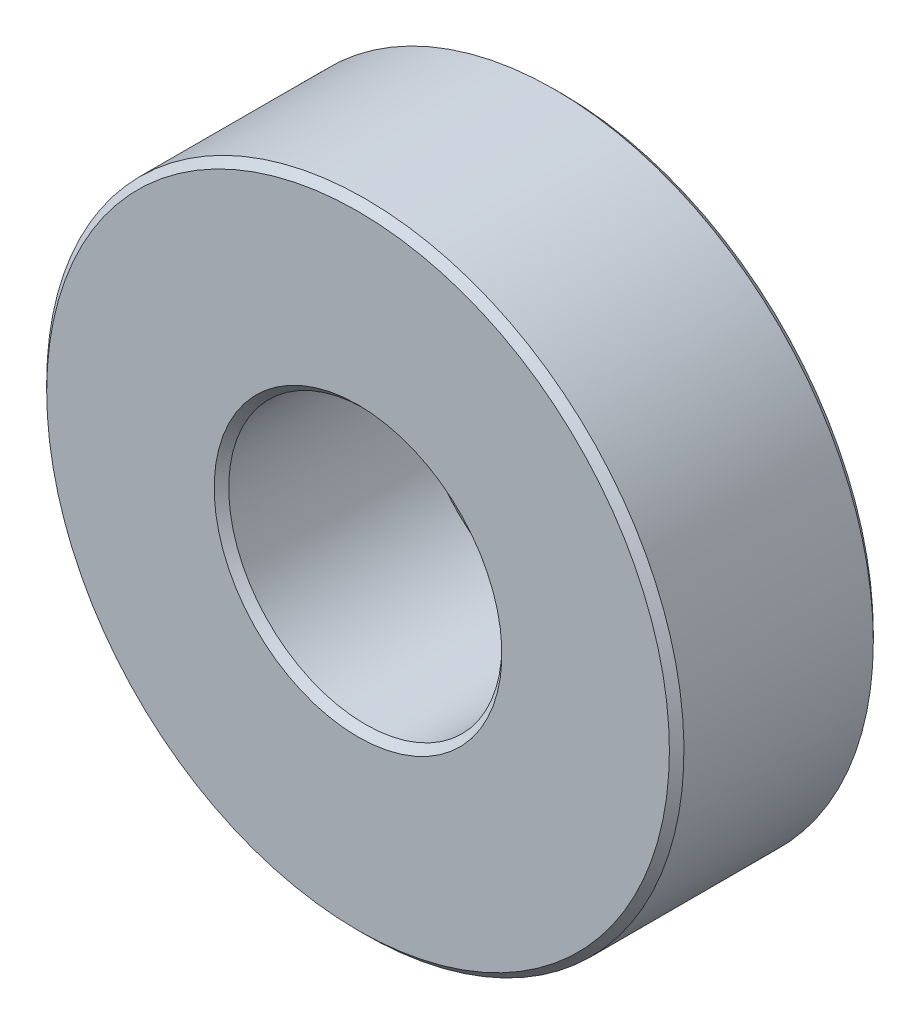
ISO-10303-21;
HEADER;
FILE_DESCRIPTION(('STEP AP214'),'2;1');
FILE_NAME('part.step','',(''),(''),'','','');
FILE_SCHEMA(('AUTOMOTIVE_DESIGN { 1 0 10303 214 1 1 1 1 }'));
ENDSEC;
DATA;
#1=APPLICATION_CONTEXT('core data for automotive mechanical design processes');
#2=APPLICATION_PROTOCOL_DEFINITION('international standard','automotive_design',2000,#1);
#3=PRODUCT_CONTEXT('',#1,'mechanical');
#4=PRODUCT('Part','Part','',(#3));
#5=PRODUCT_RELATED_PRODUCT_CATEGORY('part','',(#4));
#6=PRODUCT_DEFINITION_FORMATION('','',#4);
#7=PRODUCT_DEFINITION_CONTEXT('part definition',#1,'design');
#8=PRODUCT_DEFINITION('design','',#6,#7);
#9=PRODUCT_DEFINITION_SHAPE('','',#8);
#10=(LENGTH_UNIT() NAMED_UNIT(*) SI_UNIT(.MILLI.,.METRE.));
#11=(NAMED_UNIT(*) PLANE_ANGLE_UNIT() SI_UNIT($,.RADIAN.));
#12=(NAMED_UNIT(*) SI_UNIT($,.STERADIAN.) SOLID_ANGLE_UNIT());
#13=UNCERTAINTY_MEASURE_WITH_UNIT(LENGTH_MEASURE(1.E-05),#10,'distance_accuracy_value','');
#14=(GEOMETRIC_REPRESENTATION_CONTEXT(3) GLOBAL_UNCERTAINTY_ASSIGNED_CONTEXT((#13)) GLOBAL_UNIT_ASSIGNED_CONTEXT((#10,
#11,#12)) REPRESENTATION_CONTEXT('',''));
#15=CARTESIAN_POINT('',(0.,0.,0.));
#16=DIRECTION('',(0.,0.,1.));
#17=DIRECTION('',(1.,0.,0.));
#18=AXIS2_PLACEMENT_3D('',#15,#16,#17);
#19=CARTESIAN_POINT('',(0.,0.,0.));
#20=DIRECTION('',(0.,0.,-1.));
#21=DIRECTION('',(0.,1.,0.));
#22=AXIS2_PLACEMENT_3D('',#19,#20,#21);
#23=PLANE('',#22);
#24=CARTESIAN_POINT('',(0.,0.,-5.6843418860808E-11));
#25=DIRECTION('',(0.,0.,-1.));
#26=DIRECTION('',(0.,1.,0.));
#27=AXIS2_PLACEMENT_3D('',#24,#25,#26);
#28=CIRCLE('',#27,5.01650000001064);
#29=CARTESIAN_POINT('',(0.,5.01650000001064,-5.6843418860808E-11));
#30=VERTEX_POINT('',#29);
#31=EDGE_CURVE('E29',#30,#30,#28,.F.);
#32=ORIENTED_EDGE('',*,*,#31,.T.);
#33=EDGE_LOOP('',(#32));
#34=FACE_BOUND('',#33,.T.);
#35=CARTESIAN_POINT('',(0.,0.,0.));
#36=DIRECTION('',(0.,0.,1.));
#37=DIRECTION('',(1.,0.,0.));
#38=AXIS2_PLACEMENT_3D('',#35,#36,#37);
#39=CIRCLE('',#38,10.8585);
#40=CARTESIAN_POINT('',(10.8585,0.,0.));
#41=VERTEX_POINT('',#40);
#42=EDGE_CURVE('E15',#41,#41,#39,.T.);
#43=ORIENTED_EDGE('',*,*,#42,.F.);
#44=EDGE_LOOP('',(#43));
#45=FACE_BOUND('',#44,.T.);
#46=ADVANCED_FACE('F12',(#34,#45),#23,.T.);
#47=CARTESIAN_POINT('',(0.,0.,0.253999999999989));
#48=DIRECTION('',(0.,0.,1.));
#49=DIRECTION('',(1.,0.,0.));
#50=AXIS2_PLACEMENT_3D('',#47,#48,#49);
#51=CONICAL_SURFACE('',#50,11.1125,0.785398163397451);
#52=ORIENTED_EDGE('',*,*,#42,.T.);
#53=EDGE_LOOP('',(#52));
#54=FACE_BOUND('',#53,.T.);
#55=CARTESIAN_POINT('',(0.,0.,0.253999999999976));
#56=DIRECTION('',(0.,0.,-1.));
#57=DIRECTION('',(0.,1.,0.));
#58=AXIS2_PLACEMENT_3D('',#55,#56,#57);
#59=CIRCLE('',#58,11.1125);
#60=CARTESIAN_POINT('',(0.,11.1125,0.253999999999976));
#61=VERTEX_POINT('',#60);
#62=EDGE_CURVE('E27',#61,#61,#59,.F.);
#63=ORIENTED_EDGE('',*,*,#62,.F.);
#64=EDGE_LOOP('',(#63));
#65=FACE_BOUND('',#64,.T.);
#66=ADVANCED_FACE('F38',(#54,#65),#51,.T.);
#67=CARTESIAN_POINT('',(0.,0.,-5.6843418860808E-11));
#68=DIRECTION('',(0.,0.,-1.));
#69=DIRECTION('',(0.,1.,0.));
#70=AXIS2_PLACEMENT_3D('',#67,#68,#69);
#71=CONICAL_SURFACE('',#70,5.01650000001064,0.785398163285552);
#72=ORIENTED_EDGE('',*,*,#31,.F.);
#73=EDGE_LOOP('',(#72));
#74=FACE_BOUND('',#73,.T.);
#75=CARTESIAN_POINT('',(0.,0.,0.253999999999976));
#76=DIRECTION('',(0.,0.,-1.));
#77=DIRECTION('',(0.,1.,0.));
#78=AXIS2_PLACEMENT_3D('',#75,#76,#77);
#79=CIRCLE('',#78,4.7625);
#80=CARTESIAN_POINT('',(0.,4.7625,0.253999999999976));
#81=VERTEX_POINT('',#80);
#82=EDGE_CURVE('E34',#81,#81,#79,.F.);
#83=ORIENTED_EDGE('',*,*,#82,.T.);
#84=EDGE_LOOP('',(#83));
#85=FACE_BOUND('',#84,.T.);
#86=ADVANCED_FACE('F46',(#74,#85),#71,.F.);
#87=CARTESIAN_POINT('',(0.,0.,7.11200000000001));
#88=DIRECTION('',(0.,0.,-1.));
#89=DIRECTION('',(0.,1.,0.));
#90=AXIS2_PLACEMENT_3D('',#87,#88,#89);
#91=CYLINDRICAL_SURFACE('',#90,11.1125);
#92=CARTESIAN_POINT('',(0.,0.,6.85799999999998));
#93=DIRECTION('',(0.,0.,-1.));
#94=DIRECTION('',(-1.,0.,0.));
#95=AXIS2_PLACEMENT_3D('',#92,#93,#94);
#96=CIRCLE('',#95,11.1125);
#97=CARTESIAN_POINT('',(-11.1125,0.,6.85799999999997));
#98=VERTEX_POINT('',#97);
#99=EDGE_CURVE('E78',#98,#98,#96,.F.);
#100=ORIENTED_EDGE('',*,*,#99,.F.);
#101=EDGE_LOOP('',(#100));
#102=FACE_BOUND('',#101,.T.);
#103=ORIENTED_EDGE('',*,*,#62,.T.);
#104=EDGE_LOOP('',(#103));
#105=FACE_BOUND('',#104,.T.);
#106=ADVANCED_FACE('F66',(#102,#105),#91,.T.);
#107=CARTESIAN_POINT('',(0.,0.,7.11200000000001));
#108=DIRECTION('',(0.,0.,-1.));
#109=DIRECTION('',(0.,1.,0.));
#110=AXIS2_PLACEMENT_3D('',#107,#108,#109);
#111=CYLINDRICAL_SURFACE('',#110,4.7625);
#112=ORIENTED_EDGE('',*,*,#82,.F.);
#113=EDGE_LOOP('',(#112));
#114=FACE_BOUND('',#113,.T.);
#115=CARTESIAN_POINT('',(0.,0.,6.85800000002246));
#116=DIRECTION('',(0.,0.,1.));
#117=DIRECTION('',(1.,0.,0.));
#118=AXIS2_PLACEMENT_3D('',#115,#116,#117);
#119=CIRCLE('',#118,4.76250000002665);
#120=CARTESIAN_POINT('',(4.76250000002665,0.,6.85800000002246));
#121=VERTEX_POINT('',#120);
#122=EDGE_CURVE('E24',#121,#121,#119,.T.);
#123=ORIENTED_EDGE('',*,*,#122,.T.);
#124=EDGE_LOOP('',(#123));
#125=FACE_BOUND('',#124,.T.);
#126=ADVANCED_FACE('F62',(#114,#125),#111,.F.);
#127=CARTESIAN_POINT('',(0.,0.,6.85799999999997));
#128=DIRECTION('',(0.,0.,-1.));
#129=DIRECTION('',(0.,1.,0.));
#130=AXIS2_PLACEMENT_3D('',#127,#128,#129);
#131=CONICAL_SURFACE('',#130,11.1125,0.78539816339745);
#132=CARTESIAN_POINT('',(0.,0.,7.11199999999999));
#133=DIRECTION('',(0.,0.,-1.));
#134=DIRECTION('',(0.,1.,0.));
#135=AXIS2_PLACEMENT_3D('',#132,#133,#134);
#136=CIRCLE('',#135,10.8585);
#137=CARTESIAN_POINT('',(0.,10.8585,7.11199999999999));
#138=VERTEX_POINT('',#137);
#139=EDGE_CURVE('E19',#138,#138,#136,.T.);
#140=ORIENTED_EDGE('',*,*,#139,.T.);
#141=EDGE_LOOP('',(#140));
#142=FACE_BOUND('',#141,.T.);
#143=ORIENTED_EDGE('',*,*,#99,.T.);
#144=EDGE_LOOP('',(#143));
#145=FACE_BOUND('',#144,.T.);
#146=ADVANCED_FACE('F56',(#142,#145),#131,.T.);
#147=CARTESIAN_POINT('',(0.,0.,7.11200000000645));
#148=DIRECTION('',(0.,0.,1.));
#149=DIRECTION('',(0.,-1.,0.));
#150=AXIS2_PLACEMENT_3D('',#147,#148,#149);
#151=CONICAL_SURFACE('',#150,5.01650000001064,0.785398163397448);
#152=CARTESIAN_POINT('',(0.,0.,7.11200000000645));
#153=DIRECTION('',(0.,0.,1.));
#154=DIRECTION('',(0.,-1.,0.));
#155=AXIS2_PLACEMENT_3D('',#152,#153,#154);
#156=CIRCLE('',#155,5.01650000001064);
#157=CARTESIAN_POINT('',(0.,-5.01650000001064,7.11200000000645));
#158=VERTEX_POINT('',#157);
#159=EDGE_CURVE('E8',#158,#158,#156,.T.);
#160=ORIENTED_EDGE('',*,*,#159,.T.);
#161=EDGE_LOOP('',(#160));
#162=FACE_BOUND('',#161,.T.);
#163=ORIENTED_EDGE('',*,*,#122,.F.);
#164=EDGE_LOOP('',(#163));
#165=FACE_BOUND('',#164,.T.);
#166=ADVANCED_FACE('F49',(#162,#165),#151,.F.);
#167=CARTESIAN_POINT('',(0.,0.,7.11200000000001));
#168=DIRECTION('',(0.,0.,-1.));
#169=DIRECTION('',(0.,1.,0.));
#170=AXIS2_PLACEMENT_3D('',#167,#168,#169);
#171=PLANE('',#170);
#172=ORIENTED_EDGE('',*,*,#159,.F.);
#173=EDGE_LOOP('',(#172));
#174=FACE_BOUND('',#173,.T.);
#175=ORIENTED_EDGE('',*,*,#139,.F.);
#176=EDGE_LOOP('',(#175));
#177=FACE_BOUND('',#176,.T.);
#178=ADVANCED_FACE('F47',(#174,#177),#171,.F.);
#179=CLOSED_SHELL('',(#46,#66,#86,#106,#126,#146,#166,#178));
#180=MANIFOLD_SOLID_BREP('B1',#179);
#181=ADVANCED_BREP_SHAPE_REPRESENTATION('',(#18,#180),#14);
#182=SHAPE_DEFINITION_REPRESENTATION(#9,#181);
ENDSEC;
END-ISO-10303-21;
